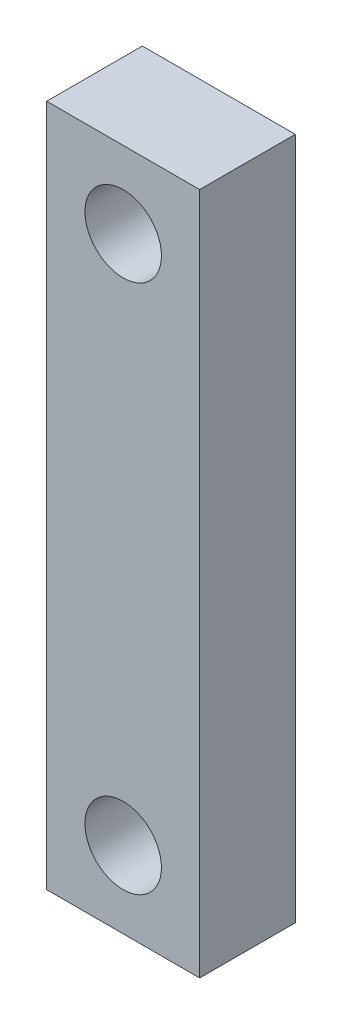
ISO-10303-21;
HEADER;
FILE_DESCRIPTION(('STEP AP214'),'2;1');
FILE_NAME('part.step','',(''),(''),'','','');
FILE_SCHEMA(('AUTOMOTIVE_DESIGN { 1 0 10303 214 1 1 1 1 }'));
ENDSEC;
DATA;
#1=APPLICATION_CONTEXT('core data for automotive mechanical design processes');
#2=APPLICATION_PROTOCOL_DEFINITION('international standard','automotive_design',2000,#1);
#3=PRODUCT_CONTEXT('',#1,'mechanical');
#4=PRODUCT('Part','Part','',(#3));
#5=PRODUCT_RELATED_PRODUCT_CATEGORY('part','',(#4));
#6=PRODUCT_DEFINITION_FORMATION('','',#4);
#7=PRODUCT_DEFINITION_CONTEXT('part definition',#1,'design');
#8=PRODUCT_DEFINITION('design','',#6,#7);
#9=PRODUCT_DEFINITION_SHAPE('','',#8);
#10=(LENGTH_UNIT() NAMED_UNIT(*) SI_UNIT(.MILLI.,.METRE.));
#11=(NAMED_UNIT(*) PLANE_ANGLE_UNIT() SI_UNIT($,.RADIAN.));
#12=(NAMED_UNIT(*) SI_UNIT($,.STERADIAN.) SOLID_ANGLE_UNIT());
#13=UNCERTAINTY_MEASURE_WITH_UNIT(LENGTH_MEASURE(1.E-05),#10,'distance_accuracy_value','');
#14=(GEOMETRIC_REPRESENTATION_CONTEXT(3) GLOBAL_UNCERTAINTY_ASSIGNED_CONTEXT((#13)) GLOBAL_UNIT_ASSIGNED_CONTEXT((#10,
#11,#12)) REPRESENTATION_CONTEXT('',''));
#15=CARTESIAN_POINT('',(0.,0.,0.));
#16=DIRECTION('',(0.,0.,1.));
#17=DIRECTION('',(1.,0.,0.));
#18=AXIS2_PLACEMENT_3D('',#15,#16,#17);
#19=CARTESIAN_POINT('',(-8.,35.7,5.));
#20=DIRECTION('',(1.,0.,0.));
#21=DIRECTION('',(0.,1.,0.));
#22=AXIS2_PLACEMENT_3D('',#19,#20,#21);
#23=PLANE('',#22);
#24=DIRECTION('',(0.,-1.,0.));
#25=VECTOR('',#24,1.);
#26=CARTESIAN_POINT('',(-8.,35.7,-5.));
#27=LINE('',#26,#25);
#28=CARTESIAN_POINT('',(-8.,35.7,-5.));
#29=VERTEX_POINT('',#28);
#30=CARTESIAN_POINT('',(-7.99999999999999,-35.7,-5.));
#31=VERTEX_POINT('',#30);
#32=EDGE_CURVE('E100',#29,#31,#27,.T.);
#33=ORIENTED_EDGE('',*,*,#32,.T.);
#34=DIRECTION('',(0.,0.,-1.));
#35=VECTOR('',#34,1.);
#36=CARTESIAN_POINT('',(-7.99999999999999,-35.7,5.));
#37=LINE('',#36,#35);
#38=CARTESIAN_POINT('',(-7.99999999999999,-35.7,5.));
#39=VERTEX_POINT('',#38);
#40=EDGE_CURVE('E11',#39,#31,#37,.T.);
#41=ORIENTED_EDGE('',*,*,#40,.F.);
#42=DIRECTION('',(0.,-1.,0.));
#43=VECTOR('',#42,1.);
#44=CARTESIAN_POINT('',(-8.,35.7,5.));
#45=LINE('',#44,#43);
#46=CARTESIAN_POINT('',(-8.,35.7,5.));
#47=VERTEX_POINT('',#46);
#48=EDGE_CURVE('E88',#47,#39,#45,.T.);
#49=ORIENTED_EDGE('',*,*,#48,.F.);
#50=DIRECTION('',(0.,0.,-1.));
#51=VECTOR('',#50,1.);
#52=CARTESIAN_POINT('',(-8.,35.7,5.));
#53=LINE('',#52,#51);
#54=EDGE_CURVE('E96',#47,#29,#53,.T.);
#55=ORIENTED_EDGE('',*,*,#54,.T.);
#56=EDGE_LOOP('',(#33,#41,#49,#55));
#57=FACE_BOUND('',#56,.T.);
#58=ADVANCED_FACE('F37',(#57),#23,.F.);
#59=CARTESIAN_POINT('',(-7.99999999999999,-35.7,5.));
#60=DIRECTION('',(0.,1.,0.));
#61=DIRECTION('',(0.,0.,1.));
#62=AXIS2_PLACEMENT_3D('',#59,#60,#61);
#63=PLANE('',#62);
#64=DIRECTION('',(1.,0.,0.));
#65=VECTOR('',#64,1.);
#66=CARTESIAN_POINT('',(-7.99999999999999,-35.7,-5.));
#67=LINE('',#66,#65);
#68=CARTESIAN_POINT('',(8.,-35.7,-5.));
#69=VERTEX_POINT('',#68);
#70=EDGE_CURVE('E92',#31,#69,#67,.T.);
#71=ORIENTED_EDGE('',*,*,#70,.T.);
#72=DIRECTION('',(0.,0.,-1.));
#73=VECTOR('',#72,1.);
#74=CARTESIAN_POINT('',(8.,-35.7,5.));
#75=LINE('',#74,#73);
#76=CARTESIAN_POINT('',(8.,-35.7,5.));
#77=VERTEX_POINT('',#76);
#78=EDGE_CURVE('E45',#77,#69,#75,.T.);
#79=ORIENTED_EDGE('',*,*,#78,.F.);
#80=DIRECTION('',(1.,0.,0.));
#81=VECTOR('',#80,1.);
#82=CARTESIAN_POINT('',(-7.99999999999999,-35.7,5.));
#83=LINE('',#82,#81);
#84=EDGE_CURVE('E83',#39,#77,#83,.T.);
#85=ORIENTED_EDGE('',*,*,#84,.F.);
#86=ORIENTED_EDGE('',*,*,#40,.T.);
#87=EDGE_LOOP('',(#71,#79,#85,#86));
#88=FACE_BOUND('',#87,.T.);
#89=ADVANCED_FACE('F91',(#88),#63,.F.);
#90=CARTESIAN_POINT('',(7.99999999999999,35.7,5.));
#91=DIRECTION('',(-1.,0.,0.));
#92=DIRECTION('',(0.,-1.,0.));
#93=AXIS2_PLACEMENT_3D('',#90,#91,#92);
#94=PLANE('',#93);
#95=DIRECTION('',(0.,1.,0.));
#96=VECTOR('',#95,1.);
#97=CARTESIAN_POINT('',(7.99999999999999,35.7,-5.));
#98=LINE('',#97,#96);
#99=CARTESIAN_POINT('',(7.99999999999999,35.7,-5.));
#100=VERTEX_POINT('',#99);
#101=EDGE_CURVE('E70',#69,#100,#98,.T.);
#102=ORIENTED_EDGE('',*,*,#101,.T.);
#103=DIRECTION('',(0.,0.,-1.));
#104=VECTOR('',#103,1.);
#105=CARTESIAN_POINT('',(7.99999999999999,35.7,5.));
#106=LINE('',#105,#104);
#107=CARTESIAN_POINT('',(7.99999999999999,35.7,5.));
#108=VERTEX_POINT('',#107);
#109=EDGE_CURVE('E93',#108,#100,#106,.T.);
#110=ORIENTED_EDGE('',*,*,#109,.F.);
#111=DIRECTION('',(0.,1.,0.));
#112=VECTOR('',#111,1.);
#113=CARTESIAN_POINT('',(7.99999999999999,35.7,5.));
#114=LINE('',#113,#112);
#115=EDGE_CURVE('E86',#77,#108,#114,.T.);
#116=ORIENTED_EDGE('',*,*,#115,.F.);
#117=ORIENTED_EDGE('',*,*,#78,.T.);
#118=EDGE_LOOP('',(#102,#110,#116,#117));
#119=FACE_BOUND('',#118,.T.);
#120=ADVANCED_FACE('F94',(#119),#94,.F.);
#121=CARTESIAN_POINT('',(-8.,35.7,5.));
#122=DIRECTION('',(0.,-1.,0.));
#123=DIRECTION('',(0.,0.,-1.));
#124=AXIS2_PLACEMENT_3D('',#121,#122,#123);
#125=PLANE('',#124);
#126=DIRECTION('',(-1.,0.,0.));
#127=VECTOR('',#126,1.);
#128=CARTESIAN_POINT('',(-8.,35.7,-5.));
#129=LINE('',#128,#127);
#130=EDGE_CURVE('E76',#100,#29,#129,.T.);
#131=ORIENTED_EDGE('',*,*,#130,.T.);
#132=ORIENTED_EDGE('',*,*,#54,.F.);
#133=DIRECTION('',(-1.,0.,0.));
#134=VECTOR('',#133,1.);
#135=CARTESIAN_POINT('',(-8.,35.7,5.));
#136=LINE('',#135,#134);
#137=EDGE_CURVE('E53',#108,#47,#136,.T.);
#138=ORIENTED_EDGE('',*,*,#137,.F.);
#139=ORIENTED_EDGE('',*,*,#109,.T.);
#140=EDGE_LOOP('',(#131,#132,#138,#139));
#141=FACE_BOUND('',#140,.T.);
#142=ADVANCED_FACE('F108',(#141),#125,.F.);
#143=CARTESIAN_POINT('',(0.,0.,5.));
#144=DIRECTION('',(0.,0.,1.));
#145=DIRECTION('',(1.,0.,0.));
#146=AXIS2_PLACEMENT_3D('',#143,#144,#145);
#147=PLANE('',#146);
#148=CARTESIAN_POINT('',(0.,-27.7,5.));
#149=DIRECTION('',(0.,0.,-1.));
#150=DIRECTION('',(1.,0.,0.));
#151=AXIS2_PLACEMENT_3D('',#148,#149,#150);
#152=CIRCLE('',#151,4.);
#153=CARTESIAN_POINT('',(4.,-27.7,5.));
#154=VERTEX_POINT('',#153);
#155=EDGE_CURVE('E120',#154,#154,#152,.T.);
#156=ORIENTED_EDGE('',*,*,#155,.T.);
#157=EDGE_LOOP('',(#156));
#158=FACE_BOUND('',#157,.T.);
#159=CARTESIAN_POINT('',(0.,27.7,5.));
#160=DIRECTION('',(0.,0.,1.));
#161=DIRECTION('',(1.,0.,0.));
#162=AXIS2_PLACEMENT_3D('',#159,#160,#161);
#163=CIRCLE('',#162,4.);
#164=CARTESIAN_POINT('',(4.,27.7,5.));
#165=VERTEX_POINT('',#164);
#166=EDGE_CURVE('E114',#165,#165,#163,.T.);
#167=ORIENTED_EDGE('',*,*,#166,.F.);
#168=EDGE_LOOP('',(#167));
#169=FACE_BOUND('',#168,.T.);
#170=ORIENTED_EDGE('',*,*,#48,.T.);
#171=ORIENTED_EDGE('',*,*,#84,.T.);
#172=ORIENTED_EDGE('',*,*,#115,.T.);
#173=ORIENTED_EDGE('',*,*,#137,.T.);
#174=EDGE_LOOP('',(#170,#171,#172,#173));
#175=FACE_BOUND('',#174,.T.);
#176=ADVANCED_FACE('F84',(#158,#169,#175),#147,.T.);
#177=CARTESIAN_POINT('',(0.,0.,-5.));
#178=DIRECTION('',(0.,0.,1.));
#179=DIRECTION('',(1.,0.,0.));
#180=AXIS2_PLACEMENT_3D('',#177,#178,#179);
#181=PLANE('',#180);
#182=CARTESIAN_POINT('',(0.,-27.7,-5.));
#183=DIRECTION('',(0.,0.,-1.));
#184=DIRECTION('',(1.,0.,0.));
#185=AXIS2_PLACEMENT_3D('',#182,#183,#184);
#186=CIRCLE('',#185,4.);
#187=CARTESIAN_POINT('',(4.,-27.7,-5.));
#188=VERTEX_POINT('',#187);
#189=EDGE_CURVE('E117',#188,#188,#186,.T.);
#190=ORIENTED_EDGE('',*,*,#189,.F.);
#191=EDGE_LOOP('',(#190));
#192=FACE_BOUND('',#191,.T.);
#193=CARTESIAN_POINT('',(0.,27.7,-5.));
#194=DIRECTION('',(0.,0.,1.));
#195=DIRECTION('',(1.,0.,0.));
#196=AXIS2_PLACEMENT_3D('',#193,#194,#195);
#197=CIRCLE('',#196,4.);
#198=CARTESIAN_POINT('',(4.,27.7,-5.));
#199=VERTEX_POINT('',#198);
#200=EDGE_CURVE('E103',#199,#199,#197,.T.);
#201=ORIENTED_EDGE('',*,*,#200,.T.);
#202=EDGE_LOOP('',(#201));
#203=FACE_BOUND('',#202,.T.);
#204=ORIENTED_EDGE('',*,*,#32,.F.);
#205=ORIENTED_EDGE('',*,*,#130,.F.);
#206=ORIENTED_EDGE('',*,*,#101,.F.);
#207=ORIENTED_EDGE('',*,*,#70,.F.);
#208=EDGE_LOOP('',(#204,#205,#206,#207));
#209=FACE_BOUND('',#208,.T.);
#210=ADVANCED_FACE('F111',(#192,#203,#209),#181,.F.);
#211=CARTESIAN_POINT('',(0.,27.7,-5.));
#212=DIRECTION('',(0.,0.,1.));
#213=DIRECTION('',(1.,0.,0.));
#214=AXIS2_PLACEMENT_3D('',#211,#212,#213);
#215=CYLINDRICAL_SURFACE('',#214,4.);
#216=ORIENTED_EDGE('',*,*,#200,.F.);
#217=EDGE_LOOP('',(#216));
#218=FACE_BOUND('',#217,.T.);
#219=ORIENTED_EDGE('',*,*,#166,.T.);
#220=EDGE_LOOP('',(#219));
#221=FACE_BOUND('',#220,.T.);
#222=ADVANCED_FACE('F131',(#218,#221),#215,.F.);
#223=CARTESIAN_POINT('',(0.,-27.7,-5.));
#224=DIRECTION('',(0.,0.,1.));
#225=DIRECTION('',(1.,0.,0.));
#226=AXIS2_PLACEMENT_3D('',#223,#224,#225);
#227=CYLINDRICAL_SURFACE('',#226,4.);
#228=ORIENTED_EDGE('',*,*,#189,.T.);
#229=EDGE_LOOP('',(#228));
#230=FACE_BOUND('',#229,.T.);
#231=ORIENTED_EDGE('',*,*,#155,.F.);
#232=EDGE_LOOP('',(#231));
#233=FACE_BOUND('',#232,.T.);
#234=ADVANCED_FACE('F126',(#230,#233),#227,.F.);
#235=CLOSED_SHELL('',(#58,#89,#120,#142,#176,#210,#222,#234));
#236=MANIFOLD_SOLID_BREP('B2',#235);
#237=ADVANCED_BREP_SHAPE_REPRESENTATION('',(#18,#236),#14);
#238=SHAPE_DEFINITION_REPRESENTATION(#9,#237);
ENDSEC;
END-ISO-10303-21;
